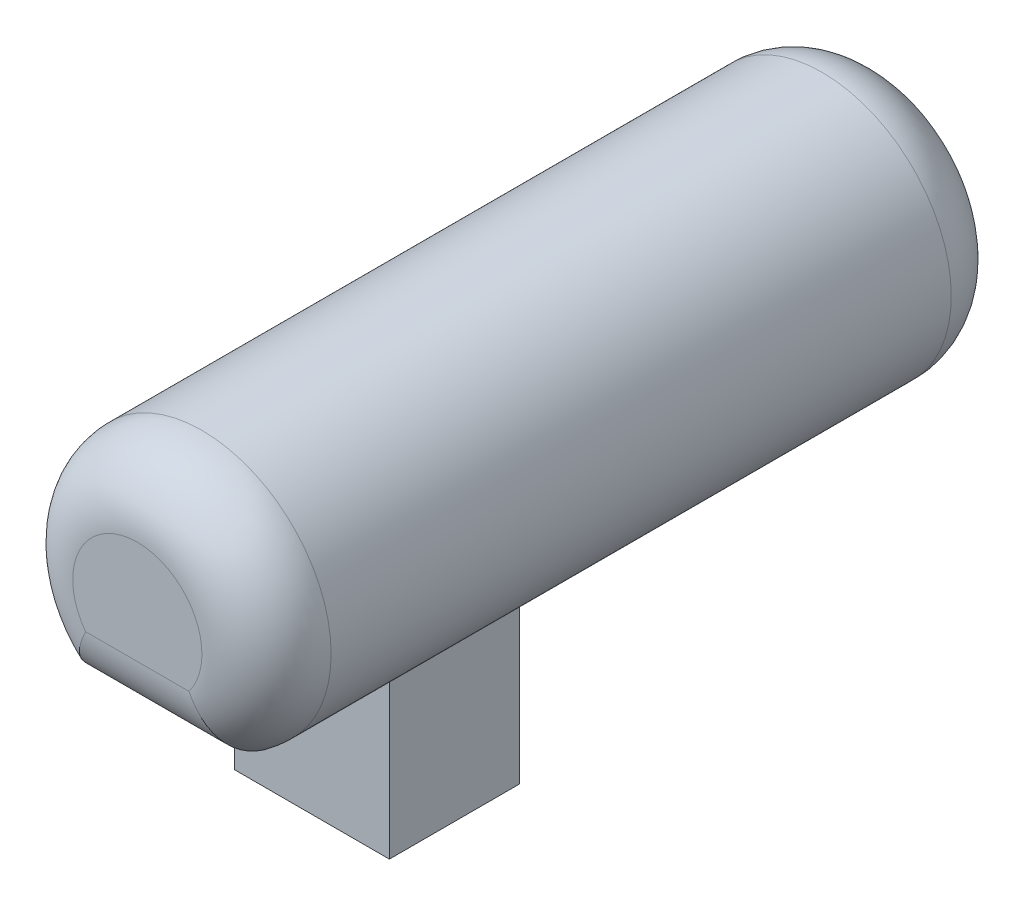
ISO-10303-21;
HEADER;
FILE_DESCRIPTION(('STEP AP214'),'2;1');
FILE_NAME('part.step','',(''),(''),'','','');
FILE_SCHEMA(('AUTOMOTIVE_DESIGN { 1 0 10303 214 1 1 1 1 }'));
ENDSEC;
DATA;
#1=APPLICATION_CONTEXT('core data for automotive mechanical design processes');
#2=APPLICATION_PROTOCOL_DEFINITION('international standard','automotive_design',2000,#1);
#3=PRODUCT_CONTEXT('',#1,'mechanical');
#4=PRODUCT('Part','Part','',(#3));
#5=PRODUCT_RELATED_PRODUCT_CATEGORY('part','',(#4));
#6=PRODUCT_DEFINITION_FORMATION('','',#4);
#7=PRODUCT_DEFINITION_CONTEXT('part definition',#1,'design');
#8=PRODUCT_DEFINITION('design','',#6,#7);
#9=PRODUCT_DEFINITION_SHAPE('','',#8);
#10=(LENGTH_UNIT() NAMED_UNIT(*) SI_UNIT(.MILLI.,.METRE.));
#11=(NAMED_UNIT(*) PLANE_ANGLE_UNIT() SI_UNIT($,.RADIAN.));
#12=(NAMED_UNIT(*) SI_UNIT($,.STERADIAN.) SOLID_ANGLE_UNIT());
#13=UNCERTAINTY_MEASURE_WITH_UNIT(LENGTH_MEASURE(1.E-05),#10,'distance_accuracy_value','');
#14=(GEOMETRIC_REPRESENTATION_CONTEXT(3) GLOBAL_UNCERTAINTY_ASSIGNED_CONTEXT((#13)) GLOBAL_UNIT_ASSIGNED_CONTEXT((#10,
#11,#12)) REPRESENTATION_CONTEXT('',''));
#15=CARTESIAN_POINT('',(0.,0.,0.));
#16=DIRECTION('',(0.,0.,1.));
#17=DIRECTION('',(1.,0.,0.));
#18=AXIS2_PLACEMENT_3D('',#15,#16,#17);
#19=CARTESIAN_POINT('',(3.,-4.,29.));
#20=DIRECTION('',(-1.,0.,0.));
#21=DIRECTION('',(0.,-1.,0.));
#22=AXIS2_PLACEMENT_3D('',#19,#20,#21);
#23=PLANE('',#22);
#24=DIRECTION('',(0.,0.,-1.));
#25=VECTOR('',#24,1.);
#26=CARTESIAN_POINT('',(3.,-10.,29.));
#27=LINE('',#26,#25);
#28=CARTESIAN_POINT('',(3.,-10.,22.2453833595042));
#29=VERTEX_POINT('',#28);
#30=CARTESIAN_POINT('',(3.,-10.,17.2092634938183));
#31=VERTEX_POINT('',#30);
#32=EDGE_CURVE('E145',#29,#31,#27,.T.);
#33=ORIENTED_EDGE('',*,*,#32,.T.);
#34=DIRECTION('',(0.,1.,0.));
#35=VECTOR('',#34,1.);
#36=CARTESIAN_POINT('',(3.,-4.,17.2092634938183));
#37=LINE('',#36,#35);
#38=CARTESIAN_POINT('',(3.,-4.,17.2092634938183));
#39=VERTEX_POINT('',#38);
#40=EDGE_CURVE('E121',#31,#39,#37,.T.);
#41=ORIENTED_EDGE('',*,*,#40,.T.);
#42=DIRECTION('',(0.,0.,-1.));
#43=VECTOR('',#42,1.);
#44=CARTESIAN_POINT('',(3.,-4.,29.));
#45=LINE('',#44,#43);
#46=CARTESIAN_POINT('',(3.,-4.,22.2453833595042));
#47=VERTEX_POINT('',#46);
#48=EDGE_CURVE('E156',#47,#39,#45,.T.);
#49=ORIENTED_EDGE('',*,*,#48,.F.);
#50=DIRECTION('',(0.,-1.,0.));
#51=VECTOR('',#50,1.);
#52=CARTESIAN_POINT('',(3.,-4.,22.2453833595042));
#53=LINE('',#52,#51);
#54=EDGE_CURVE('E151',#47,#29,#53,.T.);
#55=ORIENTED_EDGE('',*,*,#54,.T.);
#56=EDGE_LOOP('',(#33,#41,#49,#55));
#57=FACE_BOUND('',#56,.T.);
#58=ADVANCED_FACE('F39',(#57),#23,.F.);
#59=CARTESIAN_POINT('',(0.,0.,29.));
#60=DIRECTION('',(0.,0.,-1.));
#61=DIRECTION('',(-1.,0.,0.));
#62=AXIS2_PLACEMENT_3D('',#59,#60,#61);
#63=CYLINDRICAL_SURFACE('',#62,5.);
#64=DIRECTION('',(0.,0.,-1.));
#65=VECTOR('',#64,1.);
#66=CARTESIAN_POINT('',(-3.,-4.,29.));
#67=LINE('',#66,#65);
#68=CARTESIAN_POINT('',(-3.,-4.,26.5));
#69=VERTEX_POINT('',#68);
#70=CARTESIAN_POINT('',(-3.,-4.,22.2453833595042));
#71=VERTEX_POINT('',#70);
#72=EDGE_CURVE('E149',#69,#71,#67,.T.);
#73=ORIENTED_EDGE('',*,*,#72,.F.);
#74=CARTESIAN_POINT('',(0.,0.,26.5));
#75=DIRECTION('',(0.,0.,1.));
#76=DIRECTION('',(1.,0.,0.));
#77=AXIS2_PLACEMENT_3D('',#74,#75,#76);
#78=CIRCLE('',#77,5.);
#79=CARTESIAN_POINT('',(3.,-4.,26.5));
#80=VERTEX_POINT('',#79);
#81=EDGE_CURVE('E170',#69,#80,#78,.F.);
#82=ORIENTED_EDGE('',*,*,#81,.T.);
#83=EDGE_CURVE('E157',#80,#47,#45,.T.);
#84=ORIENTED_EDGE('',*,*,#83,.T.);
#85=ORIENTED_EDGE('',*,*,#48,.T.);
#86=DIRECTION('',(0.,0.,-1.));
#87=VECTOR('',#86,1.);
#88=CARTESIAN_POINT('',(3.,-4.,29.));
#89=LINE('',#88,#87);
#90=CARTESIAN_POINT('',(3.,-4.,2.5));
#91=VERTEX_POINT('',#90);
#92=EDGE_CURVE('E139',#39,#91,#89,.T.);
#93=ORIENTED_EDGE('',*,*,#92,.T.);
#94=CARTESIAN_POINT('',(0.,0.,2.5));
#95=DIRECTION('',(0.,0.,1.));
#96=DIRECTION('',(1.,0.,0.));
#97=AXIS2_PLACEMENT_3D('',#94,#95,#96);
#98=CIRCLE('',#97,5.);
#99=CARTESIAN_POINT('',(-3.,-4.,2.5));
#100=VERTEX_POINT('',#99);
#101=EDGE_CURVE('E167',#91,#100,#98,.T.);
#102=ORIENTED_EDGE('',*,*,#101,.T.);
#103=DIRECTION('',(0.,0.,1.));
#104=VECTOR('',#103,1.);
#105=CARTESIAN_POINT('',(-3.,-4.,29.));
#106=LINE('',#105,#104);
#107=CARTESIAN_POINT('',(-3.,-4.,17.2092634938183));
#108=VERTEX_POINT('',#107);
#109=EDGE_CURVE('E127',#100,#108,#106,.T.);
#110=ORIENTED_EDGE('',*,*,#109,.T.);
#111=EDGE_CURVE('E137',#71,#108,#67,.T.);
#112=ORIENTED_EDGE('',*,*,#111,.F.);
#113=EDGE_LOOP('',(#73,#82,#84,#85,#93,#102,#110,#112));
#114=FACE_BOUND('',#113,.T.);
#115=ADVANCED_FACE('F222',(#114),#63,.T.);
#116=CARTESIAN_POINT('',(-3.,-4.,29.));
#117=DIRECTION('',(1.,0.,0.));
#118=DIRECTION('',(0.,1.,0.));
#119=AXIS2_PLACEMENT_3D('',#116,#117,#118);
#120=PLANE('',#119);
#121=ORIENTED_EDGE('',*,*,#111,.T.);
#122=DIRECTION('',(0.,-1.,0.));
#123=VECTOR('',#122,1.);
#124=CARTESIAN_POINT('',(-3.,-4.,17.2092634938183));
#125=LINE('',#124,#123);
#126=CARTESIAN_POINT('',(-3.,-10.,17.2092634938183));
#127=VERTEX_POINT('',#126);
#128=EDGE_CURVE('E118',#108,#127,#125,.T.);
#129=ORIENTED_EDGE('',*,*,#128,.T.);
#130=DIRECTION('',(0.,0.,-1.));
#131=VECTOR('',#130,1.);
#132=CARTESIAN_POINT('',(-3.,-10.,29.));
#133=LINE('',#132,#131);
#134=CARTESIAN_POINT('',(-3.,-10.,22.2453833595042));
#135=VERTEX_POINT('',#134);
#136=EDGE_CURVE('E135',#135,#127,#133,.T.);
#137=ORIENTED_EDGE('',*,*,#136,.F.);
#138=DIRECTION('',(0.,1.,0.));
#139=VECTOR('',#138,1.);
#140=CARTESIAN_POINT('',(-3.,-4.,22.2453833595042));
#141=LINE('',#140,#139);
#142=EDGE_CURVE('E236',#135,#71,#141,.T.);
#143=ORIENTED_EDGE('',*,*,#142,.T.);
#144=EDGE_LOOP('',(#121,#129,#137,#143));
#145=FACE_BOUND('',#144,.T.);
#146=ADVANCED_FACE('F133',(#145),#120,.F.);
#147=CARTESIAN_POINT('',(-3.,-10.,29.));
#148=DIRECTION('',(0.,1.,0.));
#149=DIRECTION('',(0.,0.,1.));
#150=AXIS2_PLACEMENT_3D('',#147,#148,#149);
#151=PLANE('',#150);
#152=ORIENTED_EDGE('',*,*,#136,.T.);
#153=DIRECTION('',(1.,0.,0.));
#154=VECTOR('',#153,1.);
#155=CARTESIAN_POINT('',(-5.,-10.,17.2092634938183));
#156=LINE('',#155,#154);
#157=EDGE_CURVE('E114',#127,#31,#156,.T.);
#158=ORIENTED_EDGE('',*,*,#157,.T.);
#159=ORIENTED_EDGE('',*,*,#32,.F.);
#160=DIRECTION('',(1.,0.,0.));
#161=VECTOR('',#160,1.);
#162=CARTESIAN_POINT('',(-5.,-10.,22.2453833595042));
#163=LINE('',#162,#161);
#164=EDGE_CURVE('E143',#135,#29,#163,.T.);
#165=ORIENTED_EDGE('',*,*,#164,.F.);
#166=EDGE_LOOP('',(#152,#158,#159,#165));
#167=FACE_BOUND('',#166,.T.);
#168=ADVANCED_FACE('F142',(#167),#151,.F.);
#169=CARTESIAN_POINT('',(0.,0.,29.));
#170=DIRECTION('',(0.,0.,1.));
#171=DIRECTION('',(1.,0.,0.));
#172=AXIS2_PLACEMENT_3D('',#169,#170,#171);
#173=PLANE('',#172);
#174=DIRECTION('',(-1.,0.,0.));
#175=VECTOR('',#174,1.);
#176=CARTESIAN_POINT('',(3.,-1.5,29.));
#177=LINE('',#176,#175);
#178=CARTESIAN_POINT('',(-2.,-1.5,29.));
#179=VERTEX_POINT('',#178);
#180=CARTESIAN_POINT('',(2.,-1.5,29.));
#181=VERTEX_POINT('',#180);
#182=EDGE_CURVE('E160',#179,#181,#177,.F.);
#183=ORIENTED_EDGE('',*,*,#182,.T.);
#184=CARTESIAN_POINT('',(0.,0.,29.));
#185=DIRECTION('',(0.,0.,1.));
#186=DIRECTION('',(1.,0.,0.));
#187=AXIS2_PLACEMENT_3D('',#184,#185,#186);
#188=CIRCLE('',#187,2.5);
#189=EDGE_CURVE('E163',#181,#179,#188,.T.);
#190=ORIENTED_EDGE('',*,*,#189,.T.);
#191=EDGE_LOOP('',(#183,#190));
#192=FACE_BOUND('',#191,.T.);
#193=ADVANCED_FACE('F258',(#192),#173,.T.);
#194=CARTESIAN_POINT('',(0.,0.,0.));
#195=DIRECTION('',(0.,0.,1.));
#196=DIRECTION('',(1.,0.,0.));
#197=AXIS2_PLACEMENT_3D('',#194,#195,#196);
#198=PLANE('',#197);
#199=CARTESIAN_POINT('',(0.,0.,0.));
#200=DIRECTION('',(0.,0.,1.));
#201=DIRECTION('',(1.,0.,0.));
#202=AXIS2_PLACEMENT_3D('',#199,#200,#201);
#203=CIRCLE('',#202,2.5);
#204=CARTESIAN_POINT('',(-2.,-1.5,0.));
#205=VERTEX_POINT('',#204);
#206=CARTESIAN_POINT('',(2.,-1.5,0.));
#207=VERTEX_POINT('',#206);
#208=EDGE_CURVE('E61',#205,#207,#203,.F.);
#209=ORIENTED_EDGE('',*,*,#208,.T.);
#210=DIRECTION('',(-1.,0.,0.));
#211=VECTOR('',#210,1.);
#212=CARTESIAN_POINT('',(0.,-1.5,0.));
#213=LINE('',#212,#211);
#214=EDGE_CURVE('E54',#207,#205,#213,.T.);
#215=ORIENTED_EDGE('',*,*,#214,.T.);
#216=EDGE_LOOP('',(#209,#215));
#217=FACE_BOUND('',#216,.T.);
#218=ADVANCED_FACE('F260',(#217),#198,.F.);
#219=CARTESIAN_POINT('',(-5.,-4.,22.2453833595042));
#220=DIRECTION('',(0.,0.,-1.));
#221=DIRECTION('',(-1.,0.,0.));
#222=AXIS2_PLACEMENT_3D('',#219,#220,#221);
#223=PLANE('',#222);
#224=DIRECTION('',(1.,0.,0.));
#225=VECTOR('',#224,1.);
#226=CARTESIAN_POINT('',(-5.,-4.,22.2453833595042));
#227=LINE('',#226,#225);
#228=EDGE_CURVE('E232',#71,#47,#227,.T.);
#229=ORIENTED_EDGE('',*,*,#228,.F.);
#230=ORIENTED_EDGE('',*,*,#142,.F.);
#231=ORIENTED_EDGE('',*,*,#164,.T.);
#232=ORIENTED_EDGE('',*,*,#54,.F.);
#233=EDGE_LOOP('',(#229,#230,#231,#232));
#234=FACE_BOUND('',#233,.T.);
#235=ADVANCED_FACE('F246',(#234),#223,.F.);
#236=CARTESIAN_POINT('',(-5.,-4.,29.));
#237=DIRECTION('',(0.,1.,0.));
#238=DIRECTION('',(0.,0.,1.));
#239=AXIS2_PLACEMENT_3D('',#236,#237,#238);
#240=PLANE('',#239);
#241=ORIENTED_EDGE('',*,*,#83,.F.);
#242=DIRECTION('',(-1.,0.,0.));
#243=VECTOR('',#242,1.);
#244=CARTESIAN_POINT('',(-3.,-4.,26.5));
#245=LINE('',#244,#243);
#246=EDGE_CURVE('E174',#80,#69,#245,.T.);
#247=ORIENTED_EDGE('',*,*,#246,.T.);
#248=ORIENTED_EDGE('',*,*,#72,.T.);
#249=ORIENTED_EDGE('',*,*,#228,.T.);
#250=EDGE_LOOP('',(#241,#247,#248,#249));
#251=FACE_BOUND('',#250,.T.);
#252=ADVANCED_FACE('F249',(#251),#240,.F.);
#253=CARTESIAN_POINT('',(-5.,-4.,17.2092634938183));
#254=DIRECTION('',(0.,0.,1.));
#255=DIRECTION('',(1.,0.,0.));
#256=AXIS2_PLACEMENT_3D('',#253,#254,#255);
#257=PLANE('',#256);
#258=ORIENTED_EDGE('',*,*,#157,.F.);
#259=ORIENTED_EDGE('',*,*,#128,.F.);
#260=DIRECTION('',(1.,0.,0.));
#261=VECTOR('',#260,1.);
#262=CARTESIAN_POINT('',(-5.,-4.,17.2092634938183));
#263=LINE('',#262,#261);
#264=EDGE_CURVE('E128',#108,#39,#263,.T.);
#265=ORIENTED_EDGE('',*,*,#264,.T.);
#266=ORIENTED_EDGE('',*,*,#40,.F.);
#267=EDGE_LOOP('',(#258,#259,#265,#266));
#268=FACE_BOUND('',#267,.T.);
#269=ADVANCED_FACE('F116',(#268),#257,.F.);
#270=CARTESIAN_POINT('',(-5.,-4.,0.));
#271=DIRECTION('',(0.,1.,0.));
#272=DIRECTION('',(-1.,0.,0.));
#273=AXIS2_PLACEMENT_3D('',#270,#271,#272);
#274=PLANE('',#273);
#275=ORIENTED_EDGE('',*,*,#109,.F.);
#276=DIRECTION('',(-1.,0.,0.));
#277=VECTOR('',#276,1.);
#278=CARTESIAN_POINT('',(-5.,-4.,2.5));
#279=LINE('',#278,#277);
#280=EDGE_CURVE('E11',#100,#91,#279,.F.);
#281=ORIENTED_EDGE('',*,*,#280,.T.);
#282=ORIENTED_EDGE('',*,*,#92,.F.);
#283=ORIENTED_EDGE('',*,*,#264,.F.);
#284=EDGE_LOOP('',(#275,#281,#282,#283));
#285=FACE_BOUND('',#284,.T.);
#286=ADVANCED_FACE('F201',(#285),#274,.F.);
#287=CARTESIAN_POINT('',(-5.,-1.5,26.5));
#288=DIRECTION('',(1.,0.,0.));
#289=DIRECTION('',(0.,0.,-1.));
#290=AXIS2_PLACEMENT_3D('',#287,#288,#289);
#291=CYLINDRICAL_SURFACE('',#290,2.5);
#292=CARTESIAN_POINT('',(-3.,-4.,26.5));
#293=CARTESIAN_POINT('',(-3.00000106902129,-4.00000844248232,26.5674935408627));
#294=CARTESIAN_POINT('',(-2.99908891871596,-3.99726689533366,26.6349830957694));
#295=CARTESIAN_POINT('',(-2.99544707915966,-3.98634856139072,26.7694634177565));
#296=CARTESIAN_POINT('',(-2.99271762057749,-3.97817246439766,26.8364542470486));
#297=CARTESIAN_POINT('',(-2.98545677442833,-3.95646980929095,26.9693407913625));
#298=CARTESIAN_POINT('',(-2.98092872574112,-3.94295316554503,27.035238301185));
#299=CARTESIAN_POINT('',(-2.97009224408446,-3.91070948013875,27.1655776388855));
#300=CARTESIAN_POINT('',(-2.96378380678463,-3.89198242580535,27.2300194632225));
#301=CARTESIAN_POINT('',(-2.94221598330754,-3.82821199265579,27.420494762907));
#302=CARTESIAN_POINT('',(-2.92430821415144,-3.7755615041165,27.5437859732615));
#303=CARTESIAN_POINT('',(-2.88171981955822,-3.65192887804006,27.7794292389511));
#304=CARTESIAN_POINT('',(-2.8570385437182,-3.58094498013831,27.8917802423858));
#305=CARTESIAN_POINT('',(-2.80074650504927,-3.42168788142116,28.1047068665475));
#306=CARTESIAN_POINT('',(-2.76902280366526,-3.33313573332813,28.2050439987165));
#307=CARTESIAN_POINT('',(-2.6993085492468,-3.14252621307755,28.3893647204501));
#308=CARTESIAN_POINT('',(-2.66131650830578,-3.04046563558433,28.4733444169292));
#309=CARTESIAN_POINT('',(-2.57760627098021,-2.82111145815977,28.6268278583065));
#310=CARTESIAN_POINT('',(-2.53161284864426,-2.70333280399694,28.6954868848906));
#311=CARTESIAN_POINT('',(-2.43369628823922,-2.46024090174876,28.8121675851027));
#312=CARTESIAN_POINT('',(-2.38177125792926,-2.33492525535986,28.8601826497044));
#313=CARTESIAN_POINT('',(-2.27768909383235,-2.09271076461772,28.9316866678202));
#314=CARTESIAN_POINT('',(-2.22602720752667,-1.97615028019596,28.9570792174974));
#315=CARTESIAN_POINT('',(-2.11855019458635,-1.74268791506488,28.9909781553037));
#316=CARTESIAN_POINT('',(-2.06274299566998,-1.62578707688212,28.999515956432));
#317=CARTESIAN_POINT('',(-2.00333161551977,-1.50666739273319,28.9999933561331));
#318=CARTESIAN_POINT('',(-2.00166661075948,-1.50333321662407,29.0000000235877));
#319=CARTESIAN_POINT('',(-2.,-1.5,29.));
#320=B_SPLINE_CURVE_WITH_KNOTS('',3,(#292,#293,#294,#295,#296,#297,#298,#299,#300,#301,#302,
#303,#304,#305,#306,#307,#308,#309,#310,#311,#312,#313,#314,#315,#316,#317,#318,#319),
.UNSPECIFIED.,.F.,.F.,(4,2,2,2,2,2,2,2,2,2,2,2,2,4),(0.,0.202411844377023,0.404798001753889,
0.606810194898068,0.808822879391786,1.21252380517812,1.61626350854133,2.02701750865216,
2.4378691494805,2.86764075235104,3.29754984145921,3.68642327313144,4.07457125601364,
4.08575161520286),.UNSPECIFIED.);
#321=EDGE_CURVE('E181',#69,#179,#320,.T.);
#322=ORIENTED_EDGE('',*,*,#321,.F.);
#323=ORIENTED_EDGE('',*,*,#246,.F.);
#324=CARTESIAN_POINT('',(3.,-4.,26.5));
#325=CARTESIAN_POINT('',(3.00000106902129,-4.00000844248232,26.5674935408627));
#326=CARTESIAN_POINT('',(2.99908891871596,-3.99726689533366,26.6349830957694));
#327=CARTESIAN_POINT('',(2.99544707915966,-3.98634856139072,26.7694634177565));
#328=CARTESIAN_POINT('',(2.99271762057749,-3.97817246439766,26.8364542470486));
#329=CARTESIAN_POINT('',(2.98545677442833,-3.95646980929095,26.9693407913625));
#330=CARTESIAN_POINT('',(2.98092872574112,-3.94295316554503,27.035238301185));
#331=CARTESIAN_POINT('',(2.97009224408446,-3.91070948013875,27.1655776388855));
#332=CARTESIAN_POINT('',(2.96378380678463,-3.89198242580535,27.2300194632225));
#333=CARTESIAN_POINT('',(2.94221598330754,-3.82821199265579,27.420494762907));
#334=CARTESIAN_POINT('',(2.92430821415143,-3.7755615041165,27.5437859732615));
#335=CARTESIAN_POINT('',(2.88171981955821,-3.65192887804006,27.7794292389511));
#336=CARTESIAN_POINT('',(2.8570385437182,-3.58094498013831,27.8917802423858));
#337=CARTESIAN_POINT('',(2.80074650504927,-3.42168788142116,28.1047068665475));
#338=CARTESIAN_POINT('',(2.76902280366526,-3.33313573332813,28.2050439987165));
#339=CARTESIAN_POINT('',(2.6993085492468,-3.14252621307755,28.3893647204501));
#340=CARTESIAN_POINT('',(2.66131650830578,-3.04046563558433,28.4733444169292));
#341=CARTESIAN_POINT('',(2.57760627098021,-2.82111145815977,28.6268278583065));
#342=CARTESIAN_POINT('',(2.53161284864426,-2.70333280399695,28.6954868848906));
#343=CARTESIAN_POINT('',(2.43369628823922,-2.46024090174876,28.8121675851027));
#344=CARTESIAN_POINT('',(2.38177125792926,-2.33492525535986,28.8601826497044));
#345=CARTESIAN_POINT('',(2.27768909383235,-2.09271076461772,28.9316866678202));
#346=CARTESIAN_POINT('',(2.22602720752667,-1.97615028019596,28.9570792174974));
#347=CARTESIAN_POINT('',(2.11855019458635,-1.74268791506488,28.9909781553037));
#348=CARTESIAN_POINT('',(2.06274299566998,-1.62578707688212,28.999515956432));
#349=CARTESIAN_POINT('',(2.00333161551977,-1.50666739273319,28.9999933561331));
#350=CARTESIAN_POINT('',(2.00166661075948,-1.50333321662407,29.0000000235877));
#351=CARTESIAN_POINT('',(2.,-1.5,29.));
#352=B_SPLINE_CURVE_WITH_KNOTS('',3,(#324,#325,#326,#327,#328,#329,#330,#331,#332,#333,#334,
#335,#336,#337,#338,#339,#340,#341,#342,#343,#344,#345,#346,#347,#348,#349,#350,#351),
.UNSPECIFIED.,.F.,.F.,(4,2,2,2,2,2,2,2,2,2,2,2,2,4),(0.,0.202411844377023,0.404798001753889,
0.606810194898072,0.808822879391786,1.21252380517813,1.61626350854133,2.02701750865216,
2.4378691494805,2.86764075235103,3.29754984145921,3.68642327313144,4.07457125601364,
4.08575161520286),.UNSPECIFIED.);
#353=EDGE_CURVE('E190',#181,#80,#352,.F.);
#354=ORIENTED_EDGE('',*,*,#353,.F.);
#355=ORIENTED_EDGE('',*,*,#182,.F.);
#356=EDGE_LOOP('',(#322,#323,#354,#355));
#357=FACE_BOUND('',#356,.T.);
#358=ADVANCED_FACE('F198',(#357),#291,.T.);
#359=CARTESIAN_POINT('',(0.,0.,26.5));
#360=DIRECTION('',(0.,0.,1.));
#361=DIRECTION('',(1.,0.,0.));
#362=AXIS2_PLACEMENT_3D('',#359,#360,#361);
#363=DEGENERATE_TOROIDAL_SURFACE('',#362,2.5,2.5,.T.);
#364=ORIENTED_EDGE('',*,*,#353,.T.);
#365=ORIENTED_EDGE('',*,*,#81,.F.);
#366=ORIENTED_EDGE('',*,*,#321,.T.);
#367=ORIENTED_EDGE('',*,*,#189,.F.);
#368=EDGE_LOOP('',(#364,#365,#366,#367));
#369=FACE_BOUND('',#368,.T.);
#370=ADVANCED_FACE('F195',(#369),#363,.T.);
#371=CARTESIAN_POINT('',(0.,0.,2.5));
#372=DIRECTION('',(0.,0.,1.));
#373=DIRECTION('',(1.,0.,0.));
#374=AXIS2_PLACEMENT_3D('',#371,#372,#373);
#375=DEGENERATE_TOROIDAL_SURFACE('',#374,2.5,2.5,.T.);
#376=CARTESIAN_POINT('',(-3.,-4.,2.5));
#377=CARTESIAN_POINT('',(-3.00000106902129,-4.00000844248232,2.43250645913731));
#378=CARTESIAN_POINT('',(-2.99908891871596,-3.99726689533366,2.36501690423062));
#379=CARTESIAN_POINT('',(-2.99544707915966,-3.98634856139072,2.23053658224348));
#380=CARTESIAN_POINT('',(-2.99271762057749,-3.97817246439766,2.16354575295146));
#381=CARTESIAN_POINT('',(-2.98545677442833,-3.95646980929095,2.03065920863746));
#382=CARTESIAN_POINT('',(-2.98092872574112,-3.94295316554503,1.96476169881504));
#383=CARTESIAN_POINT('',(-2.97009224408446,-3.91070948013875,1.83442236111453));
#384=CARTESIAN_POINT('',(-2.96378380678463,-3.89198242580535,1.76998053677747));
#385=CARTESIAN_POINT('',(-2.94221598330754,-3.82821199265579,1.57950523709306));
#386=CARTESIAN_POINT('',(-2.92430821415144,-3.7755615041165,1.45621402673853));
#387=CARTESIAN_POINT('',(-2.88171981955822,-3.65192887804006,1.22057076104889));
#388=CARTESIAN_POINT('',(-2.8570385437182,-3.58094498013831,1.10821975761416));
#389=CARTESIAN_POINT('',(-2.80074650504927,-3.42168788142116,0.895293133452533));
#390=CARTESIAN_POINT('',(-2.76902280366524,-3.33313573332812,0.794956001283519));
#391=CARTESIAN_POINT('',(-2.6993085492468,-3.14252621307753,0.610635279549861));
#392=CARTESIAN_POINT('',(-2.66131650830581,-3.04046563558431,0.526655583070821));
#393=CARTESIAN_POINT('',(-2.5776062709802,-2.82111145815981,0.373172141693521));
#394=CARTESIAN_POINT('',(-2.53161284864417,-2.70333280399706,0.30451311510946));
#395=CARTESIAN_POINT('',(-2.43369628823936,-2.46024090174877,0.187832414897354));
#396=CARTESIAN_POINT('',(-2.38177125792968,-2.33492525535969,0.139817350295591));
#397=CARTESIAN_POINT('',(-2.27768909383197,-2.09271076461785,0.0683133321797526));
#398=CARTESIAN_POINT('',(-2.22602720752533,-1.97615028019651,0.04292078250256));
#399=CARTESIAN_POINT('',(-2.11855019458762,-1.74268791506413,0.0090218446963406));
#400=CARTESIAN_POINT('',(-2.06274299567478,-1.62578707687967,0.000484043567986584));
#401=CARTESIAN_POINT('',(-2.00333161552005,-1.50666739273305,6.64386686534714E-06));
#402=CARTESIAN_POINT('',(-2.00166661075962,-1.503333216624,-2.35877256468278E-08));
#403=CARTESIAN_POINT('',(-2.,-1.5,0.));
#404=B_SPLINE_CURVE_WITH_KNOTS('',3,(#376,#377,#378,#379,#380,#381,#382,#383,#384,#385,#386,
#387,#388,#389,#390,#391,#392,#393,#394,#395,#396,#397,#398,#399,#400,#401,#402,#403),
.UNSPECIFIED.,.F.,.F.,(4,2,2,2,2,2,2,2,2,2,2,2,2,4),(0.,0.202411844377026,0.404798001753893,
0.606810194898076,0.808822879391786,1.21252380517812,1.61626350854133,2.02701750865219,
2.4378691494805,2.86764075235093,3.29754984145921,3.6864232731316,4.07457125601364,
4.08575161520287),.UNSPECIFIED.);
#405=EDGE_CURVE('E69',#100,#205,#404,.T.);
#406=ORIENTED_EDGE('',*,*,#405,.F.);
#407=ORIENTED_EDGE('',*,*,#101,.F.);
#408=CARTESIAN_POINT('',(3.,-4.,2.5));
#409=CARTESIAN_POINT('',(3.00000106902129,-4.00000844248232,2.43250645913731));
#410=CARTESIAN_POINT('',(2.99908891871596,-3.99726689533366,2.36501690423062));
#411=CARTESIAN_POINT('',(2.99544707915966,-3.98634856139072,2.23053658224348));
#412=CARTESIAN_POINT('',(2.99271762057749,-3.97817246439766,2.16354575295146));
#413=CARTESIAN_POINT('',(2.98545677442833,-3.95646980929095,2.03065920863746));
#414=CARTESIAN_POINT('',(2.98092872574112,-3.94295316554503,1.96476169881504));
#415=CARTESIAN_POINT('',(2.97009224408446,-3.91070948013875,1.83442236111453));
#416=CARTESIAN_POINT('',(2.96378380678463,-3.89198242580535,1.76998053677747));
#417=CARTESIAN_POINT('',(2.94221598330754,-3.82821199265579,1.57950523709306));
#418=CARTESIAN_POINT('',(2.92430821415144,-3.7755615041165,1.45621402673853));
#419=CARTESIAN_POINT('',(2.88171981955822,-3.65192887804006,1.22057076104889));
#420=CARTESIAN_POINT('',(2.8570385437182,-3.58094498013831,1.10821975761416));
#421=CARTESIAN_POINT('',(2.80074650504927,-3.42168788142116,0.895293133452534));
#422=CARTESIAN_POINT('',(2.76902280366524,-3.33313573332812,0.794956001283519));
#423=CARTESIAN_POINT('',(2.6993085492468,-3.14252621307753,0.610635279549861));
#424=CARTESIAN_POINT('',(2.66131650830581,-3.04046563558431,0.526655583070821));
#425=CARTESIAN_POINT('',(2.5776062709802,-2.82111145815981,0.373172141693521));
#426=CARTESIAN_POINT('',(2.53161284864418,-2.70333280399706,0.30451311510946));
#427=CARTESIAN_POINT('',(2.43369628823936,-2.46024090174877,0.187832414897354));
#428=CARTESIAN_POINT('',(2.38177125792968,-2.33492525535969,0.139817350295591));
#429=CARTESIAN_POINT('',(2.27768909383197,-2.09271076461785,0.0683133321797525));
#430=CARTESIAN_POINT('',(2.22602720752533,-1.97615028019651,0.0429207825025598));
#431=CARTESIAN_POINT('',(2.11855019458761,-1.74268791506413,0.00902184469634046));
#432=CARTESIAN_POINT('',(2.06274299567478,-1.62578707687967,0.00048404356798657));
#433=CARTESIAN_POINT('',(2.00333161552005,-1.50666739273305,6.64386686534691E-06));
#434=CARTESIAN_POINT('',(2.00166661075962,-1.503333216624,-2.35877256467784E-08));
#435=CARTESIAN_POINT('',(2.,-1.5,0.));
#436=B_SPLINE_CURVE_WITH_KNOTS('',3,(#408,#409,#410,#411,#412,#413,#414,#415,#416,#417,#418,
#419,#420,#421,#422,#423,#424,#425,#426,#427,#428,#429,#430,#431,#432,#433,#434,#435),
.UNSPECIFIED.,.F.,.F.,(4,2,2,2,2,2,2,2,2,2,2,2,2,4),(0.,0.202411844377025,0.404798001753893,
0.606810194898075,0.808822879391786,1.21252380517812,1.61626350854133,2.02701750865219,
2.4378691494805,2.86764075235093,3.29754984145921,3.6864232731316,4.07457125601364,
4.08575161520287),.UNSPECIFIED.);
#437=EDGE_CURVE('E44',#207,#91,#436,.F.);
#438=ORIENTED_EDGE('',*,*,#437,.F.);
#439=ORIENTED_EDGE('',*,*,#208,.F.);
#440=EDGE_LOOP('',(#406,#407,#438,#439));
#441=FACE_BOUND('',#440,.T.);
#442=ADVANCED_FACE('F41',(#441),#375,.T.);
#443=CARTESIAN_POINT('',(0.,-1.5,2.5));
#444=DIRECTION('',(-1.,0.,0.));
#445=DIRECTION('',(0.,-1.,0.));
#446=AXIS2_PLACEMENT_3D('',#443,#444,#445);
#447=CYLINDRICAL_SURFACE('',#446,2.5);
#448=ORIENTED_EDGE('',*,*,#437,.T.);
#449=ORIENTED_EDGE('',*,*,#280,.F.);
#450=ORIENTED_EDGE('',*,*,#405,.T.);
#451=ORIENTED_EDGE('',*,*,#214,.F.);
#452=EDGE_LOOP('',(#448,#449,#450,#451));
#453=FACE_BOUND('',#452,.T.);
#454=ADVANCED_FACE('F203',(#453),#447,.T.);
#455=CLOSED_SHELL('',(#58,#115,#146,#168,#193,#218,#235,#252,#269,#286,#358,#370,#442,#454));
#456=MANIFOLD_SOLID_BREP('B2',#455);
#457=ADVANCED_BREP_SHAPE_REPRESENTATION('',(#18,#456),#14);
#458=SHAPE_DEFINITION_REPRESENTATION(#9,#457);
ENDSEC;
END-ISO-10303-21;
